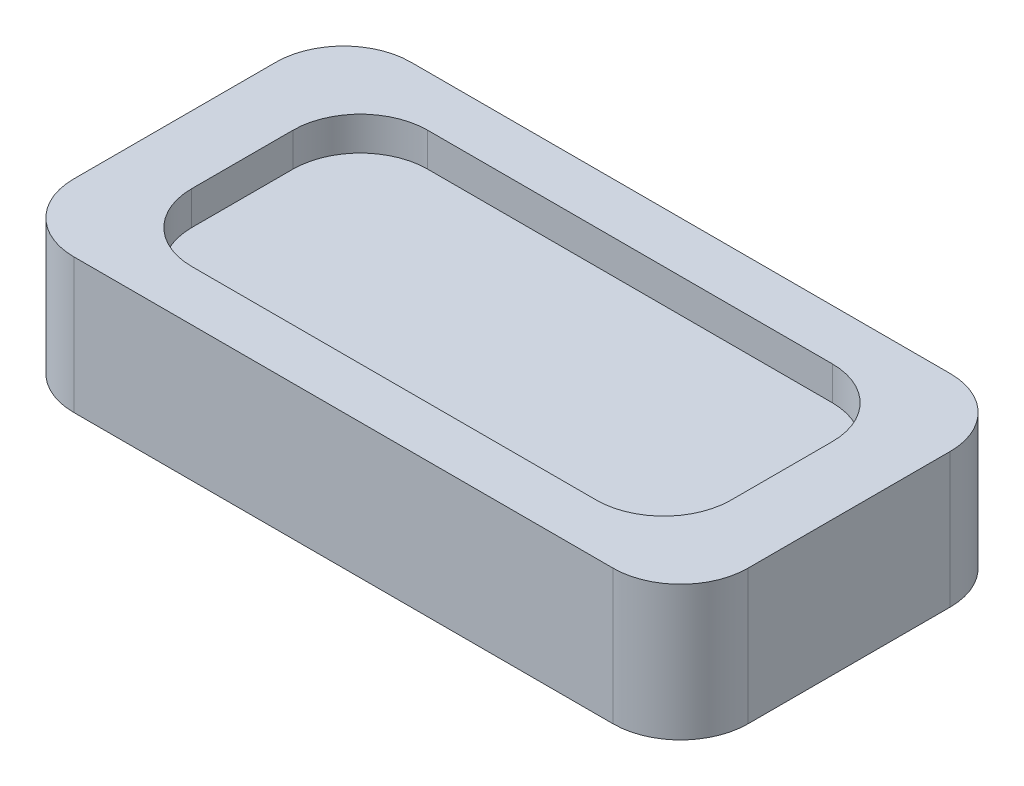
ISO-10303-21;
HEADER;
FILE_DESCRIPTION(('STEP AP214'),'2;1');
FILE_NAME('part.step','',(''),(''),'','','');
FILE_SCHEMA(('AUTOMOTIVE_DESIGN { 1 0 10303 214 1 1 1 1 }'));
ENDSEC;
DATA;
#1=APPLICATION_CONTEXT('core data for automotive mechanical design processes');
#2=APPLICATION_PROTOCOL_DEFINITION('international standard','automotive_design',2000,#1);
#3=PRODUCT_CONTEXT('',#1,'mechanical');
#4=PRODUCT('Part','Part','',(#3));
#5=PRODUCT_RELATED_PRODUCT_CATEGORY('part','',(#4));
#6=PRODUCT_DEFINITION_FORMATION('','',#4);
#7=PRODUCT_DEFINITION_CONTEXT('part definition',#1,'design');
#8=PRODUCT_DEFINITION('design','',#6,#7);
#9=PRODUCT_DEFINITION_SHAPE('','',#8);
#10=(LENGTH_UNIT() NAMED_UNIT(*) SI_UNIT(.MILLI.,.METRE.));
#11=(NAMED_UNIT(*) PLANE_ANGLE_UNIT() SI_UNIT($,.RADIAN.));
#12=(NAMED_UNIT(*) SI_UNIT($,.STERADIAN.) SOLID_ANGLE_UNIT());
#13=UNCERTAINTY_MEASURE_WITH_UNIT(LENGTH_MEASURE(1.E-05),#10,'distance_accuracy_value','');
#14=(GEOMETRIC_REPRESENTATION_CONTEXT(3) GLOBAL_UNCERTAINTY_ASSIGNED_CONTEXT((#13)) GLOBAL_UNIT_ASSIGNED_CONTEXT((#10,
#11,#12)) REPRESENTATION_CONTEXT('',''));
#15=CARTESIAN_POINT('',(0.,0.,0.));
#16=DIRECTION('',(0.,0.,1.));
#17=DIRECTION('',(1.,0.,0.));
#18=AXIS2_PLACEMENT_3D('',#15,#16,#17);
#19=CARTESIAN_POINT('',(-50.,20.,-25.));
#20=DIRECTION('',(1.,0.,0.));
#21=DIRECTION('',(0.,0.,-1.));
#22=AXIS2_PLACEMENT_3D('',#19,#20,#21);
#23=PLANE('',#22);
#24=DIRECTION('',(0.,0.,1.));
#25=VECTOR('',#24,1.);
#26=CARTESIAN_POINT('',(-50.,20.,-25.));
#27=LINE('',#26,#25);
#28=CARTESIAN_POINT('',(-50.,20.,-15.));
#29=VERTEX_POINT('',#28);
#30=CARTESIAN_POINT('',(-50.,20.,15.));
#31=VERTEX_POINT('',#30);
#32=EDGE_CURVE('E174',#29,#31,#27,.T.);
#33=ORIENTED_EDGE('',*,*,#32,.F.);
#34=DIRECTION('',(0.,-1.,0.));
#35=VECTOR('',#34,1.);
#36=CARTESIAN_POINT('',(-50.,0.,-15.));
#37=LINE('',#36,#35);
#38=CARTESIAN_POINT('',(-50.,0.,-15.));
#39=VERTEX_POINT('',#38);
#40=EDGE_CURVE('E159',#29,#39,#37,.T.);
#41=ORIENTED_EDGE('',*,*,#40,.T.);
#42=DIRECTION('',(0.,0.,1.));
#43=VECTOR('',#42,1.);
#44=CARTESIAN_POINT('',(-50.,0.,-25.));
#45=LINE('',#44,#43);
#46=CARTESIAN_POINT('',(-50.,0.,15.));
#47=VERTEX_POINT('',#46);
#48=EDGE_CURVE('E171',#39,#47,#45,.T.);
#49=ORIENTED_EDGE('',*,*,#48,.T.);
#50=DIRECTION('',(0.,-1.,0.));
#51=VECTOR('',#50,1.);
#52=CARTESIAN_POINT('',(-50.,20.,15.));
#53=LINE('',#52,#51);
#54=EDGE_CURVE('E176',#47,#31,#53,.F.);
#55=ORIENTED_EDGE('',*,*,#54,.T.);
#56=EDGE_LOOP('',(#33,#41,#49,#55));
#57=FACE_BOUND('',#56,.T.);
#58=ADVANCED_FACE('F43',(#57),#23,.F.);
#59=CARTESIAN_POINT('',(-50.,20.,25.));
#60=DIRECTION('',(0.,0.,-1.));
#61=DIRECTION('',(-1.,0.,0.));
#62=AXIS2_PLACEMENT_3D('',#59,#60,#61);
#63=PLANE('',#62);
#64=DIRECTION('',(1.,0.,0.));
#65=VECTOR('',#64,1.);
#66=CARTESIAN_POINT('',(-50.,20.,25.));
#67=LINE('',#66,#65);
#68=CARTESIAN_POINT('',(-40.,20.,25.));
#69=VERTEX_POINT('',#68);
#70=CARTESIAN_POINT('',(40.,20.,25.));
#71=VERTEX_POINT('',#70);
#72=EDGE_CURVE('E293',#69,#71,#67,.T.);
#73=ORIENTED_EDGE('',*,*,#72,.F.);
#74=DIRECTION('',(0.,-1.,0.));
#75=VECTOR('',#74,1.);
#76=CARTESIAN_POINT('',(-40.,20.,25.));
#77=LINE('',#76,#75);
#78=CARTESIAN_POINT('',(-40.,0.,25.));
#79=VERTEX_POINT('',#78);
#80=EDGE_CURVE('E215',#69,#79,#77,.T.);
#81=ORIENTED_EDGE('',*,*,#80,.T.);
#82=DIRECTION('',(1.,0.,0.));
#83=VECTOR('',#82,1.);
#84=CARTESIAN_POINT('',(-50.,0.,25.));
#85=LINE('',#84,#83);
#86=CARTESIAN_POINT('',(40.,0.,25.));
#87=VERTEX_POINT('',#86);
#88=EDGE_CURVE('E180',#79,#87,#85,.T.);
#89=ORIENTED_EDGE('',*,*,#88,.T.);
#90=DIRECTION('',(0.,-1.,0.));
#91=VECTOR('',#90,1.);
#92=CARTESIAN_POINT('',(40.,20.,25.));
#93=LINE('',#92,#91);
#94=EDGE_CURVE('E213',#87,#71,#93,.F.);
#95=ORIENTED_EDGE('',*,*,#94,.T.);
#96=EDGE_LOOP('',(#73,#81,#89,#95));
#97=FACE_BOUND('',#96,.T.);
#98=ADVANCED_FACE('F317',(#97),#63,.F.);
#99=CARTESIAN_POINT('',(50.,20.,-25.));
#100=DIRECTION('',(1.,0.,0.));
#101=DIRECTION('',(0.,0.,-1.));
#102=AXIS2_PLACEMENT_3D('',#99,#100,#101);
#103=PLANE('',#102);
#104=DIRECTION('',(0.,0.,1.));
#105=VECTOR('',#104,1.);
#106=CARTESIAN_POINT('',(50.,0.,-25.));
#107=LINE('',#106,#105);
#108=CARTESIAN_POINT('',(50.,0.,-15.));
#109=VERTEX_POINT('',#108);
#110=CARTESIAN_POINT('',(50.,0.,15.));
#111=VERTEX_POINT('',#110);
#112=EDGE_CURVE('E184',#109,#111,#107,.T.);
#113=ORIENTED_EDGE('',*,*,#112,.F.);
#114=DIRECTION('',(0.,-1.,0.));
#115=VECTOR('',#114,1.);
#116=CARTESIAN_POINT('',(50.,20.,-15.));
#117=LINE('',#116,#115);
#118=CARTESIAN_POINT('',(50.,20.,-15.));
#119=VERTEX_POINT('',#118);
#120=EDGE_CURVE('E221',#109,#119,#117,.F.);
#121=ORIENTED_EDGE('',*,*,#120,.T.);
#122=DIRECTION('',(0.,0.,1.));
#123=VECTOR('',#122,1.);
#124=CARTESIAN_POINT('',(50.,20.,-25.));
#125=LINE('',#124,#123);
#126=CARTESIAN_POINT('',(50.,20.,15.));
#127=VERTEX_POINT('',#126);
#128=EDGE_CURVE('E295',#119,#127,#125,.T.);
#129=ORIENTED_EDGE('',*,*,#128,.T.);
#130=DIRECTION('',(0.,-1.,0.));
#131=VECTOR('',#130,1.);
#132=CARTESIAN_POINT('',(50.,0.,15.));
#133=LINE('',#132,#131);
#134=EDGE_CURVE('E218',#127,#111,#133,.T.);
#135=ORIENTED_EDGE('',*,*,#134,.T.);
#136=EDGE_LOOP('',(#113,#121,#129,#135));
#137=FACE_BOUND('',#136,.T.);
#138=ADVANCED_FACE('F310',(#137),#103,.T.);
#139=CARTESIAN_POINT('',(-50.,20.,-25.));
#140=DIRECTION('',(0.,0.,-1.));
#141=DIRECTION('',(-1.,0.,0.));
#142=AXIS2_PLACEMENT_3D('',#139,#140,#141);
#143=PLANE('',#142);
#144=DIRECTION('',(1.,0.,0.));
#145=VECTOR('',#144,1.);
#146=CARTESIAN_POINT('',(-50.,0.,-25.));
#147=LINE('',#146,#145);
#148=CARTESIAN_POINT('',(-40.,0.,-25.));
#149=VERTEX_POINT('',#148);
#150=CARTESIAN_POINT('',(40.,0.,-25.));
#151=VERTEX_POINT('',#150);
#152=EDGE_CURVE('E195',#149,#151,#147,.T.);
#153=ORIENTED_EDGE('',*,*,#152,.F.);
#154=DIRECTION('',(0.,-1.,0.));
#155=VECTOR('',#154,1.);
#156=CARTESIAN_POINT('',(-40.,20.,-25.));
#157=LINE('',#156,#155);
#158=CARTESIAN_POINT('',(-40.,20.,-25.));
#159=VERTEX_POINT('',#158);
#160=EDGE_CURVE('E160',#149,#159,#157,.F.);
#161=ORIENTED_EDGE('',*,*,#160,.T.);
#162=DIRECTION('',(1.,0.,0.));
#163=VECTOR('',#162,1.);
#164=CARTESIAN_POINT('',(-50.,20.,-25.));
#165=LINE('',#164,#163);
#166=CARTESIAN_POINT('',(40.,20.,-25.));
#167=VERTEX_POINT('',#166);
#168=EDGE_CURVE('E190',#159,#167,#165,.T.);
#169=ORIENTED_EDGE('',*,*,#168,.T.);
#170=DIRECTION('',(0.,-1.,0.));
#171=VECTOR('',#170,1.);
#172=CARTESIAN_POINT('',(40.,20.,-25.));
#173=LINE('',#172,#171);
#174=EDGE_CURVE('E165',#167,#151,#173,.T.);
#175=ORIENTED_EDGE('',*,*,#174,.T.);
#176=EDGE_LOOP('',(#153,#161,#169,#175));
#177=FACE_BOUND('',#176,.T.);
#178=ADVANCED_FACE('F304',(#177),#143,.T.);
#179=CARTESIAN_POINT('',(0.,20.,0.));
#180=DIRECTION('',(0.,1.,0.));
#181=DIRECTION('',(0.,0.,1.));
#182=AXIS2_PLACEMENT_3D('',#179,#180,#181);
#183=PLANE('',#182);
#184=DIRECTION('',(0.,0.,1.));
#185=VECTOR('',#184,1.);
#186=CARTESIAN_POINT('',(-40.,20.,-17.5));
#187=LINE('',#186,#185);
#188=CARTESIAN_POINT('',(-40.,20.,-7.5));
#189=VERTEX_POINT('',#188);
#190=CARTESIAN_POINT('',(-40.,20.,7.5));
#191=VERTEX_POINT('',#190);
#192=EDGE_CURVE('E269',#189,#191,#187,.T.);
#193=ORIENTED_EDGE('',*,*,#192,.F.);
#194=CARTESIAN_POINT('',(-30.,20.,-7.5));
#195=DIRECTION('',(0.,1.,0.));
#196=DIRECTION('',(0.,0.,1.));
#197=AXIS2_PLACEMENT_3D('',#194,#195,#196);
#198=CIRCLE('',#197,10.);
#199=CARTESIAN_POINT('',(-30.,20.,-17.5));
#200=VERTEX_POINT('',#199);
#201=EDGE_CURVE('E51',#189,#200,#198,.F.);
#202=ORIENTED_EDGE('',*,*,#201,.T.);
#203=DIRECTION('',(-1.,0.,0.));
#204=VECTOR('',#203,1.);
#205=CARTESIAN_POINT('',(-40.,20.,-17.5));
#206=LINE('',#205,#204);
#207=CARTESIAN_POINT('',(30.,20.,-17.5));
#208=VERTEX_POINT('',#207);
#209=EDGE_CURVE('E290',#208,#200,#206,.T.);
#210=ORIENTED_EDGE('',*,*,#209,.F.);
#211=CARTESIAN_POINT('',(30.,20.,-7.5));
#212=DIRECTION('',(0.,1.,0.));
#213=DIRECTION('',(0.,0.,1.));
#214=AXIS2_PLACEMENT_3D('',#211,#212,#213);
#215=CIRCLE('',#214,10.);
#216=CARTESIAN_POINT('',(40.,20.,-7.5));
#217=VERTEX_POINT('',#216);
#218=EDGE_CURVE('E11',#208,#217,#215,.F.);
#219=ORIENTED_EDGE('',*,*,#218,.T.);
#220=DIRECTION('',(0.,0.,-1.));
#221=VECTOR('',#220,1.);
#222=CARTESIAN_POINT('',(40.,20.,-17.5));
#223=LINE('',#222,#221);
#224=CARTESIAN_POINT('',(40.,20.,7.50000000000001));
#225=VERTEX_POINT('',#224);
#226=EDGE_CURVE('E260',#225,#217,#223,.T.);
#227=ORIENTED_EDGE('',*,*,#226,.F.);
#228=CARTESIAN_POINT('',(30.,20.,7.5));
#229=DIRECTION('',(0.,1.,0.));
#230=DIRECTION('',(0.,0.,1.));
#231=AXIS2_PLACEMENT_3D('',#228,#229,#230);
#232=CIRCLE('',#231,10.);
#233=CARTESIAN_POINT('',(30.,20.,17.5));
#234=VERTEX_POINT('',#233);
#235=EDGE_CURVE('E252',#225,#234,#232,.F.);
#236=ORIENTED_EDGE('',*,*,#235,.T.);
#237=DIRECTION('',(1.,0.,0.));
#238=VECTOR('',#237,1.);
#239=CARTESIAN_POINT('',(-40.,20.,17.5));
#240=LINE('',#239,#238);
#241=CARTESIAN_POINT('',(-30.,20.,17.5));
#242=VERTEX_POINT('',#241);
#243=EDGE_CURVE('E258',#242,#234,#240,.T.);
#244=ORIENTED_EDGE('',*,*,#243,.F.);
#245=CARTESIAN_POINT('',(-30.,20.,7.5));
#246=DIRECTION('',(0.,1.,0.));
#247=DIRECTION('',(0.,0.,1.));
#248=AXIS2_PLACEMENT_3D('',#245,#246,#247);
#249=CIRCLE('',#248,10.);
#250=EDGE_CURVE('E250',#242,#191,#249,.F.);
#251=ORIENTED_EDGE('',*,*,#250,.T.);
#252=EDGE_LOOP('',(#193,#202,#210,#219,#227,#236,#244,#251));
#253=FACE_BOUND('',#252,.T.);
#254=ORIENTED_EDGE('',*,*,#168,.F.);
#255=CARTESIAN_POINT('',(-40.,20.,-15.));
#256=DIRECTION('',(0.,1.,0.));
#257=DIRECTION('',(0.,0.,1.));
#258=AXIS2_PLACEMENT_3D('',#255,#256,#257);
#259=CIRCLE('',#258,10.);
#260=EDGE_CURVE('E211',#159,#29,#259,.T.);
#261=ORIENTED_EDGE('',*,*,#260,.T.);
#262=ORIENTED_EDGE('',*,*,#32,.T.);
#263=CARTESIAN_POINT('',(-40.,20.,15.));
#264=DIRECTION('',(0.,1.,0.));
#265=DIRECTION('',(0.,0.,1.));
#266=AXIS2_PLACEMENT_3D('',#263,#264,#265);
#267=CIRCLE('',#266,10.);
#268=EDGE_CURVE('E209',#31,#69,#267,.T.);
#269=ORIENTED_EDGE('',*,*,#268,.T.);
#270=ORIENTED_EDGE('',*,*,#72,.T.);
#271=CARTESIAN_POINT('',(40.,20.,15.));
#272=DIRECTION('',(0.,1.,0.));
#273=DIRECTION('',(0.,0.,1.));
#274=AXIS2_PLACEMENT_3D('',#271,#272,#273);
#275=CIRCLE('',#274,10.);
#276=EDGE_CURVE('E205',#71,#127,#275,.T.);
#277=ORIENTED_EDGE('',*,*,#276,.T.);
#278=ORIENTED_EDGE('',*,*,#128,.F.);
#279=CARTESIAN_POINT('',(40.,20.,-15.));
#280=DIRECTION('',(0.,1.,0.));
#281=DIRECTION('',(0.,0.,1.));
#282=AXIS2_PLACEMENT_3D('',#279,#280,#281);
#283=CIRCLE('',#282,10.);
#284=EDGE_CURVE('E207',#119,#167,#283,.T.);
#285=ORIENTED_EDGE('',*,*,#284,.T.);
#286=EDGE_LOOP('',(#254,#261,#262,#269,#270,#277,#278,#285));
#287=FACE_BOUND('',#286,.T.);
#288=ADVANCED_FACE('F256',(#253,#287),#183,.T.);
#289=CARTESIAN_POINT('',(0.,0.,0.));
#290=DIRECTION('',(0.,1.,0.));
#291=DIRECTION('',(0.,0.,1.));
#292=AXIS2_PLACEMENT_3D('',#289,#290,#291);
#293=PLANE('',#292);
#294=ORIENTED_EDGE('',*,*,#48,.F.);
#295=CARTESIAN_POINT('',(-40.,0.,-15.));
#296=DIRECTION('',(0.,1.,0.));
#297=DIRECTION('',(0.,0.,1.));
#298=AXIS2_PLACEMENT_3D('',#295,#296,#297);
#299=CIRCLE('',#298,10.);
#300=EDGE_CURVE('E155',#39,#149,#299,.F.);
#301=ORIENTED_EDGE('',*,*,#300,.T.);
#302=ORIENTED_EDGE('',*,*,#152,.T.);
#303=CARTESIAN_POINT('',(40.,0.,-15.));
#304=DIRECTION('',(0.,1.,0.));
#305=DIRECTION('',(0.,0.,1.));
#306=AXIS2_PLACEMENT_3D('',#303,#304,#305);
#307=CIRCLE('',#306,10.);
#308=EDGE_CURVE('E199',#151,#109,#307,.F.);
#309=ORIENTED_EDGE('',*,*,#308,.T.);
#310=ORIENTED_EDGE('',*,*,#112,.T.);
#311=CARTESIAN_POINT('',(40.,0.,15.));
#312=DIRECTION('',(0.,1.,0.));
#313=DIRECTION('',(0.,0.,1.));
#314=AXIS2_PLACEMENT_3D('',#311,#312,#313);
#315=CIRCLE('',#314,10.);
#316=EDGE_CURVE('E175',#111,#87,#315,.F.);
#317=ORIENTED_EDGE('',*,*,#316,.T.);
#318=ORIENTED_EDGE('',*,*,#88,.F.);
#319=CARTESIAN_POINT('',(-40.,0.,15.));
#320=DIRECTION('',(0.,1.,0.));
#321=DIRECTION('',(0.,0.,1.));
#322=AXIS2_PLACEMENT_3D('',#319,#320,#321);
#323=CIRCLE('',#322,10.);
#324=EDGE_CURVE('E166',#79,#47,#323,.F.);
#325=ORIENTED_EDGE('',*,*,#324,.T.);
#326=EDGE_LOOP('',(#294,#301,#302,#309,#310,#317,#318,#325));
#327=FACE_BOUND('',#326,.T.);
#328=ADVANCED_FACE('F178',(#327),#293,.F.);
#329=CARTESIAN_POINT('',(-40.,15.,-17.5));
#330=DIRECTION('',(-1.,0.,0.));
#331=DIRECTION('',(0.,0.,1.));
#332=AXIS2_PLACEMENT_3D('',#329,#330,#331);
#333=PLANE('',#332);
#334=ORIENTED_EDGE('',*,*,#192,.T.);
#335=DIRECTION('',(0.,1.,0.));
#336=VECTOR('',#335,1.);
#337=CARTESIAN_POINT('',(-40.,15.,7.5));
#338=LINE('',#337,#336);
#339=CARTESIAN_POINT('',(-40.,15.,7.5));
#340=VERTEX_POINT('',#339);
#341=EDGE_CURVE('E231',#191,#340,#338,.F.);
#342=ORIENTED_EDGE('',*,*,#341,.T.);
#343=DIRECTION('',(0.,0.,1.));
#344=VECTOR('',#343,1.);
#345=CARTESIAN_POINT('',(-40.,15.,-17.5));
#346=LINE('',#345,#344);
#347=CARTESIAN_POINT('',(-40.,15.,-7.5));
#348=VERTEX_POINT('',#347);
#349=EDGE_CURVE('E283',#348,#340,#346,.T.);
#350=ORIENTED_EDGE('',*,*,#349,.F.);
#351=DIRECTION('',(0.,1.,0.));
#352=VECTOR('',#351,1.);
#353=CARTESIAN_POINT('',(-40.,20.,-7.5));
#354=LINE('',#353,#352);
#355=EDGE_CURVE('E228',#348,#189,#354,.T.);
#356=ORIENTED_EDGE('',*,*,#355,.T.);
#357=EDGE_LOOP('',(#334,#342,#350,#356));
#358=FACE_BOUND('',#357,.T.);
#359=ADVANCED_FACE('F329',(#358),#333,.F.);
#360=CARTESIAN_POINT('',(-40.,15.,-17.5));
#361=DIRECTION('',(0.,0.,-1.));
#362=DIRECTION('',(-1.,0.,0.));
#363=AXIS2_PLACEMENT_3D('',#360,#361,#362);
#364=PLANE('',#363);
#365=ORIENTED_EDGE('',*,*,#209,.T.);
#366=DIRECTION('',(0.,1.,0.));
#367=VECTOR('',#366,1.);
#368=CARTESIAN_POINT('',(-30.,15.,-17.5));
#369=LINE('',#368,#367);
#370=CARTESIAN_POINT('',(-30.,15.,-17.5));
#371=VERTEX_POINT('',#370);
#372=EDGE_CURVE('E248',#200,#371,#369,.F.);
#373=ORIENTED_EDGE('',*,*,#372,.T.);
#374=DIRECTION('',(-1.,0.,0.));
#375=VECTOR('',#374,1.);
#376=CARTESIAN_POINT('',(-40.,15.,-17.5));
#377=LINE('',#376,#375);
#378=CARTESIAN_POINT('',(30.,15.,-17.5));
#379=VERTEX_POINT('',#378);
#380=EDGE_CURVE('E181',#379,#371,#377,.T.);
#381=ORIENTED_EDGE('',*,*,#380,.F.);
#382=DIRECTION('',(0.,1.,0.));
#383=VECTOR('',#382,1.);
#384=CARTESIAN_POINT('',(30.,20.,-17.5));
#385=LINE('',#384,#383);
#386=EDGE_CURVE('E246',#379,#208,#385,.T.);
#387=ORIENTED_EDGE('',*,*,#386,.T.);
#388=EDGE_LOOP('',(#365,#373,#381,#387));
#389=FACE_BOUND('',#388,.T.);
#390=ADVANCED_FACE('F368',(#389),#364,.F.);
#391=CARTESIAN_POINT('',(40.,15.,-17.5));
#392=DIRECTION('',(1.,0.,0.));
#393=DIRECTION('',(0.,0.,-1.));
#394=AXIS2_PLACEMENT_3D('',#391,#392,#393);
#395=PLANE('',#394);
#396=DIRECTION('',(0.,0.,-1.));
#397=VECTOR('',#396,1.);
#398=CARTESIAN_POINT('',(40.,15.,-17.5));
#399=LINE('',#398,#397);
#400=CARTESIAN_POINT('',(40.,15.,7.50000000000001));
#401=VERTEX_POINT('',#400);
#402=CARTESIAN_POINT('',(40.,15.,-7.5));
#403=VERTEX_POINT('',#402);
#404=EDGE_CURVE('E187',#401,#403,#399,.T.);
#405=ORIENTED_EDGE('',*,*,#404,.F.);
#406=DIRECTION('',(0.,1.,0.));
#407=VECTOR('',#406,1.);
#408=CARTESIAN_POINT('',(40.,20.,7.50000000000001));
#409=LINE('',#408,#407);
#410=EDGE_CURVE('E243',#401,#225,#409,.T.);
#411=ORIENTED_EDGE('',*,*,#410,.T.);
#412=ORIENTED_EDGE('',*,*,#226,.T.);
#413=DIRECTION('',(0.,1.,0.));
#414=VECTOR('',#413,1.);
#415=CARTESIAN_POINT('',(40.,15.,-7.5));
#416=LINE('',#415,#414);
#417=EDGE_CURVE('E241',#217,#403,#416,.F.);
#418=ORIENTED_EDGE('',*,*,#417,.T.);
#419=EDGE_LOOP('',(#405,#411,#412,#418));
#420=FACE_BOUND('',#419,.T.);
#421=ADVANCED_FACE('F281',(#420),#395,.F.);
#422=CARTESIAN_POINT('',(-40.,15.,17.5));
#423=DIRECTION('',(0.,0.,1.));
#424=DIRECTION('',(1.,0.,0.));
#425=AXIS2_PLACEMENT_3D('',#422,#423,#424);
#426=PLANE('',#425);
#427=DIRECTION('',(1.,0.,0.));
#428=VECTOR('',#427,1.);
#429=CARTESIAN_POINT('',(-40.,15.,17.5));
#430=LINE('',#429,#428);
#431=CARTESIAN_POINT('',(-30.,15.,17.5));
#432=VERTEX_POINT('',#431);
#433=CARTESIAN_POINT('',(30.,15.,17.5));
#434=VERTEX_POINT('',#433);
#435=EDGE_CURVE('E279',#432,#434,#430,.T.);
#436=ORIENTED_EDGE('',*,*,#435,.F.);
#437=DIRECTION('',(0.,1.,0.));
#438=VECTOR('',#437,1.);
#439=CARTESIAN_POINT('',(-30.,20.,17.5));
#440=LINE('',#439,#438);
#441=EDGE_CURVE('E225',#432,#242,#440,.T.);
#442=ORIENTED_EDGE('',*,*,#441,.T.);
#443=ORIENTED_EDGE('',*,*,#243,.T.);
#444=DIRECTION('',(0.,1.,0.));
#445=VECTOR('',#444,1.);
#446=CARTESIAN_POINT('',(30.,15.,17.5));
#447=LINE('',#446,#445);
#448=EDGE_CURVE('E223',#234,#434,#447,.F.);
#449=ORIENTED_EDGE('',*,*,#448,.T.);
#450=EDGE_LOOP('',(#436,#442,#443,#449));
#451=FACE_BOUND('',#450,.T.);
#452=ADVANCED_FACE('F266',(#451),#426,.F.);
#453=CARTESIAN_POINT('',(0.,15.,0.));
#454=DIRECTION('',(0.,1.,0.));
#455=DIRECTION('',(0.,0.,1.));
#456=AXIS2_PLACEMENT_3D('',#453,#454,#455);
#457=PLANE('',#456);
#458=ORIENTED_EDGE('',*,*,#349,.T.);
#459=CARTESIAN_POINT('',(-30.,15.,7.5));
#460=DIRECTION('',(0.,1.,0.));
#461=DIRECTION('',(0.,0.,1.));
#462=AXIS2_PLACEMENT_3D('',#459,#460,#461);
#463=CIRCLE('',#462,10.);
#464=EDGE_CURVE('E239',#340,#432,#463,.T.);
#465=ORIENTED_EDGE('',*,*,#464,.T.);
#466=ORIENTED_EDGE('',*,*,#435,.T.);
#467=CARTESIAN_POINT('',(30.,15.,7.5));
#468=DIRECTION('',(0.,1.,0.));
#469=DIRECTION('',(0.,0.,1.));
#470=AXIS2_PLACEMENT_3D('',#467,#468,#469);
#471=CIRCLE('',#470,10.);
#472=EDGE_CURVE('E237',#434,#401,#471,.T.);
#473=ORIENTED_EDGE('',*,*,#472,.T.);
#474=ORIENTED_EDGE('',*,*,#404,.T.);
#475=CARTESIAN_POINT('',(30.,15.,-7.5));
#476=DIRECTION('',(0.,1.,0.));
#477=DIRECTION('',(0.,0.,1.));
#478=AXIS2_PLACEMENT_3D('',#475,#476,#477);
#479=CIRCLE('',#478,10.);
#480=EDGE_CURVE('E233',#403,#379,#479,.T.);
#481=ORIENTED_EDGE('',*,*,#480,.T.);
#482=ORIENTED_EDGE('',*,*,#380,.T.);
#483=CARTESIAN_POINT('',(-30.,15.,-7.5));
#484=DIRECTION('',(0.,1.,0.));
#485=DIRECTION('',(0.,0.,1.));
#486=AXIS2_PLACEMENT_3D('',#483,#484,#485);
#487=CIRCLE('',#486,10.);
#488=EDGE_CURVE('E235',#371,#348,#487,.T.);
#489=ORIENTED_EDGE('',*,*,#488,.T.);
#490=EDGE_LOOP('',(#458,#465,#466,#473,#474,#481,#482,#489));
#491=FACE_BOUND('',#490,.T.);
#492=ADVANCED_FACE('F277',(#491),#457,.T.);
#493=CARTESIAN_POINT('',(-40.,20.,-15.));
#494=DIRECTION('',(0.,1.,0.));
#495=DIRECTION('',(0.,0.,1.));
#496=AXIS2_PLACEMENT_3D('',#493,#494,#495);
#497=CYLINDRICAL_SURFACE('',#496,10.);
#498=ORIENTED_EDGE('',*,*,#260,.F.);
#499=ORIENTED_EDGE('',*,*,#160,.F.);
#500=ORIENTED_EDGE('',*,*,#300,.F.);
#501=ORIENTED_EDGE('',*,*,#40,.F.);
#502=EDGE_LOOP('',(#498,#499,#500,#501));
#503=FACE_BOUND('',#502,.T.);
#504=ADVANCED_FACE('F158',(#503),#497,.T.);
#505=CARTESIAN_POINT('',(-40.,20.,15.));
#506=DIRECTION('',(0.,-1.,0.));
#507=DIRECTION('',(0.,0.,-1.));
#508=AXIS2_PLACEMENT_3D('',#505,#506,#507);
#509=CYLINDRICAL_SURFACE('',#508,10.);
#510=ORIENTED_EDGE('',*,*,#268,.F.);
#511=ORIENTED_EDGE('',*,*,#54,.F.);
#512=ORIENTED_EDGE('',*,*,#324,.F.);
#513=ORIENTED_EDGE('',*,*,#80,.F.);
#514=EDGE_LOOP('',(#510,#511,#512,#513));
#515=FACE_BOUND('',#514,.T.);
#516=ADVANCED_FACE('F321',(#515),#509,.T.);
#517=CARTESIAN_POINT('',(40.,20.,-15.));
#518=DIRECTION('',(0.,-1.,0.));
#519=DIRECTION('',(0.,0.,-1.));
#520=AXIS2_PLACEMENT_3D('',#517,#518,#519);
#521=CYLINDRICAL_SURFACE('',#520,10.);
#522=ORIENTED_EDGE('',*,*,#284,.F.);
#523=ORIENTED_EDGE('',*,*,#120,.F.);
#524=ORIENTED_EDGE('',*,*,#308,.F.);
#525=ORIENTED_EDGE('',*,*,#174,.F.);
#526=EDGE_LOOP('',(#522,#523,#524,#525));
#527=FACE_BOUND('',#526,.T.);
#528=ADVANCED_FACE('F307',(#527),#521,.T.);
#529=CARTESIAN_POINT('',(40.,20.,15.));
#530=DIRECTION('',(0.,1.,0.));
#531=DIRECTION('',(0.,0.,1.));
#532=AXIS2_PLACEMENT_3D('',#529,#530,#531);
#533=CYLINDRICAL_SURFACE('',#532,10.);
#534=ORIENTED_EDGE('',*,*,#276,.F.);
#535=ORIENTED_EDGE('',*,*,#94,.F.);
#536=ORIENTED_EDGE('',*,*,#316,.F.);
#537=ORIENTED_EDGE('',*,*,#134,.F.);
#538=EDGE_LOOP('',(#534,#535,#536,#537));
#539=FACE_BOUND('',#538,.T.);
#540=ADVANCED_FACE('F313',(#539),#533,.T.);
#541=CARTESIAN_POINT('',(-30.,15.,7.5));
#542=DIRECTION('',(0.,-1.,0.));
#543=DIRECTION('',(0.,0.,-1.));
#544=AXIS2_PLACEMENT_3D('',#541,#542,#543);
#545=CYLINDRICAL_SURFACE('',#544,10.);
#546=ORIENTED_EDGE('',*,*,#464,.F.);
#547=ORIENTED_EDGE('',*,*,#341,.F.);
#548=ORIENTED_EDGE('',*,*,#250,.F.);
#549=ORIENTED_EDGE('',*,*,#441,.F.);
#550=EDGE_LOOP('',(#546,#547,#548,#549));
#551=FACE_BOUND('',#550,.T.);
#552=ADVANCED_FACE('F349',(#551),#545,.F.);
#553=CARTESIAN_POINT('',(30.,15.,7.5));
#554=DIRECTION('',(0.,-1.,0.));
#555=DIRECTION('',(0.,0.,-1.));
#556=AXIS2_PLACEMENT_3D('',#553,#554,#555);
#557=CYLINDRICAL_SURFACE('',#556,10.);
#558=ORIENTED_EDGE('',*,*,#472,.F.);
#559=ORIENTED_EDGE('',*,*,#448,.F.);
#560=ORIENTED_EDGE('',*,*,#235,.F.);
#561=ORIENTED_EDGE('',*,*,#410,.F.);
#562=EDGE_LOOP('',(#558,#559,#560,#561));
#563=FACE_BOUND('',#562,.T.);
#564=ADVANCED_FACE('F272',(#563),#557,.F.);
#565=CARTESIAN_POINT('',(-30.,15.,-7.5));
#566=DIRECTION('',(0.,-1.,0.));
#567=DIRECTION('',(0.,0.,-1.));
#568=AXIS2_PLACEMENT_3D('',#565,#566,#567);
#569=CYLINDRICAL_SURFACE('',#568,10.);
#570=ORIENTED_EDGE('',*,*,#488,.F.);
#571=ORIENTED_EDGE('',*,*,#372,.F.);
#572=ORIENTED_EDGE('',*,*,#201,.F.);
#573=ORIENTED_EDGE('',*,*,#355,.F.);
#574=EDGE_LOOP('',(#570,#571,#572,#573));
#575=FACE_BOUND('',#574,.T.);
#576=ADVANCED_FACE('F354',(#575),#569,.F.);
#577=CARTESIAN_POINT('',(30.,15.,-7.5));
#578=DIRECTION('',(0.,-1.,0.));
#579=DIRECTION('',(0.,0.,-1.));
#580=AXIS2_PLACEMENT_3D('',#577,#578,#579);
#581=CYLINDRICAL_SURFACE('',#580,10.);
#582=ORIENTED_EDGE('',*,*,#480,.F.);
#583=ORIENTED_EDGE('',*,*,#417,.F.);
#584=ORIENTED_EDGE('',*,*,#218,.F.);
#585=ORIENTED_EDGE('',*,*,#386,.F.);
#586=EDGE_LOOP('',(#582,#583,#584,#585));
#587=FACE_BOUND('',#586,.T.);
#588=ADVANCED_FACE('F45',(#587),#581,.F.);
#589=CLOSED_SHELL('',(#58,#98,#138,#178,#288,#328,#359,#390,#421,#452,#492,#504,#516,#528,#540,
#552,#564,#576,#588));
#590=MANIFOLD_SOLID_BREP('B2',#589);
#591=ADVANCED_BREP_SHAPE_REPRESENTATION('',(#18,#590),#14);
#592=SHAPE_DEFINITION_REPRESENTATION(#9,#591);
ENDSEC;
END-ISO-10303-21;
